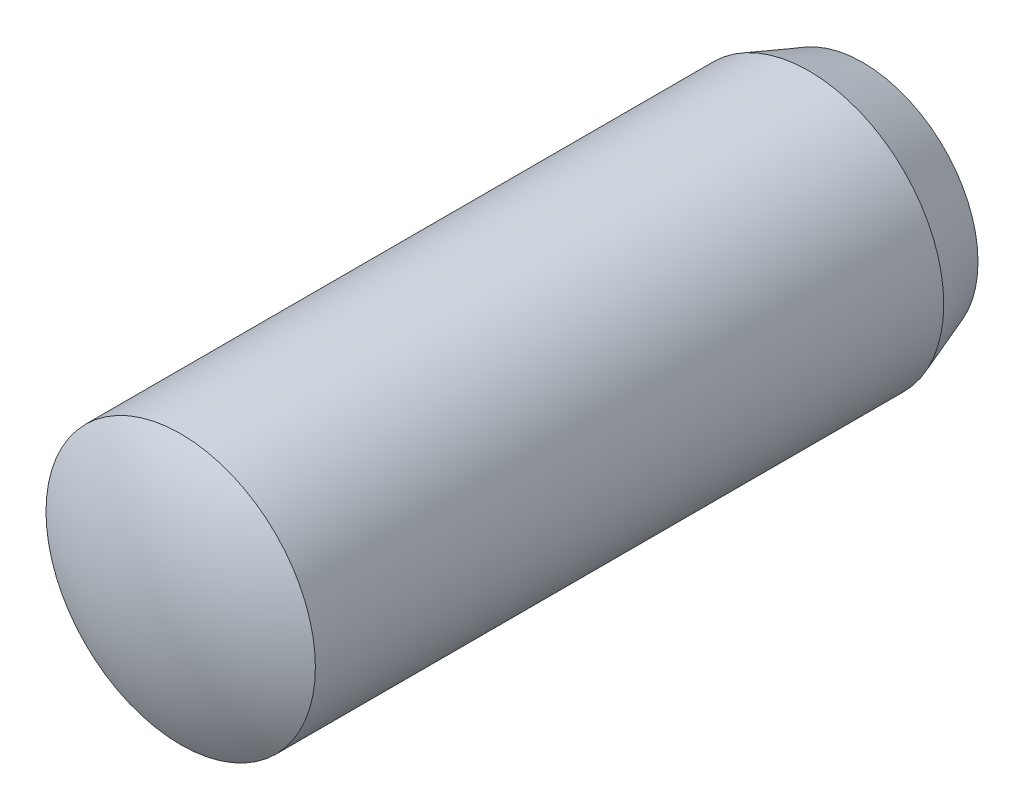
ISO-10303-21;
HEADER;
FILE_DESCRIPTION(('STEP AP214'),'2;1');
FILE_NAME('part.step','',(''),(''),'','','');
FILE_SCHEMA(('AUTOMOTIVE_DESIGN { 1 0 10303 214 1 1 1 1 }'));
ENDSEC;
DATA;
#1=APPLICATION_CONTEXT('core data for automotive mechanical design processes');
#2=APPLICATION_PROTOCOL_DEFINITION('international standard','automotive_design',2000,#1);
#3=PRODUCT_CONTEXT('',#1,'mechanical');
#4=PRODUCT('Part','Part','',(#3));
#5=PRODUCT_RELATED_PRODUCT_CATEGORY('part','',(#4));
#6=PRODUCT_DEFINITION_FORMATION('','',#4);
#7=PRODUCT_DEFINITION_CONTEXT('part definition',#1,'design');
#8=PRODUCT_DEFINITION('design','',#6,#7);
#9=PRODUCT_DEFINITION_SHAPE('','',#8);
#10=(LENGTH_UNIT() NAMED_UNIT(*) SI_UNIT(.MILLI.,.METRE.));
#11=(NAMED_UNIT(*) PLANE_ANGLE_UNIT() SI_UNIT($,.RADIAN.));
#12=(NAMED_UNIT(*) SI_UNIT($,.STERADIAN.) SOLID_ANGLE_UNIT());
#13=UNCERTAINTY_MEASURE_WITH_UNIT(LENGTH_MEASURE(1.E-05),#10,'distance_accuracy_value','');
#14=(GEOMETRIC_REPRESENTATION_CONTEXT(3) GLOBAL_UNCERTAINTY_ASSIGNED_CONTEXT((#13)) GLOBAL_UNIT_ASSIGNED_CONTEXT((#10,
#11,#12)) REPRESENTATION_CONTEXT('',''));
#15=CARTESIAN_POINT('',(0.,0.,0.));
#16=DIRECTION('',(0.,0.,1.));
#17=DIRECTION('',(1.,0.,0.));
#18=AXIS2_PLACEMENT_3D('',#15,#16,#17);
#19=CARTESIAN_POINT('',(0.,2.56323571888056,0.));
#20=DIRECTION('',(0.,0.,0.999999999999999));
#21=DIRECTION('',(1.,0.,0.));
#22=AXIS2_PLACEMENT_3D('',#19,#20,#21);
#23=PLANE('',#22);
#24=CARTESIAN_POINT('',(0.,0.,0.));
#25=DIRECTION('',(0.,0.,-0.999999999999999));
#26=DIRECTION('',(-1.,0.,0.));
#27=AXIS2_PLACEMENT_3D('',#24,#25,#26);
#28=CIRCLE('',#27,2.56323571888055);
#29=CARTESIAN_POINT('',(-2.56323571888056,0.,0.));
#30=VERTEX_POINT('',#29);
#31=EDGE_CURVE('E28',#30,#30,#28,.T.);
#32=ORIENTED_EDGE('',*,*,#31,.T.);
#33=EDGE_LOOP('',(#32));
#34=FACE_BOUND('',#33,.T.);
#35=ADVANCED_FACE('F14',(#34),#23,.F.);
#36=CARTESIAN_POINT('',(0.,0.,9.99999999999995));
#37=DIRECTION('',(-1.,0.,0.));
#38=DIRECTION('',(0.,0.,0.999999999999999));
#39=AXIS2_PLACEMENT_3D('',#36,#37,#38);
#40=SPHERICAL_SURFACE('',#39,6.);
#41=CARTESIAN_POINT('',(0.,0.,9.99999999999995));
#42=DIRECTION('',(0.,0.,-1.));
#43=DIRECTION('',(-1.,0.,0.));
#44=AXIS2_PLACEMENT_3D('',#41,#42,#43);
#45=SPHERICAL_SURFACE('',#44,6.);
#46=CARTESIAN_POINT('',(0.,0.,15.1961524227066));
#47=DIRECTION('',(0.,0.,-0.999999999999999));
#48=DIRECTION('',(-1.,0.,0.));
#49=AXIS2_PLACEMENT_3D('',#46,#47,#48);
#50=CIRCLE('',#49,3.);
#51=CARTESIAN_POINT('',(-3.,0.,15.1961524227066));
#52=VERTEX_POINT('',#51);
#53=EDGE_CURVE('E10',#52,#52,#50,.T.);
#54=ORIENTED_EDGE('',*,*,#53,.F.);
#55=EDGE_LOOP('',(#54));
#56=FACE_BOUND('',#55,.T.);
#57=ADVANCED_FACE('F47',(#56),#45,.T.);
#58=CARTESIAN_POINT('',(0.,0.,0.));
#59=DIRECTION('',(0.,0.,-0.999999999999999));
#60=DIRECTION('',(-1.,0.,0.));
#61=AXIS2_PLACEMENT_3D('',#58,#59,#60);
#62=CYLINDRICAL_SURFACE('',#61,3.);
#63=CARTESIAN_POINT('',(0.,0.,1.19999999999998));
#64=DIRECTION('',(0.,0.,-0.999999999999999));
#65=DIRECTION('',(-1.,0.,0.));
#66=AXIS2_PLACEMENT_3D('',#63,#64,#65);
#67=CIRCLE('',#66,3.);
#68=CARTESIAN_POINT('',(-3.,0.,1.19999999999998));
#69=VERTEX_POINT('',#68);
#70=EDGE_CURVE('E21',#69,#69,#67,.T.);
#71=ORIENTED_EDGE('',*,*,#70,.F.);
#72=EDGE_LOOP('',(#71));
#73=FACE_BOUND('',#72,.T.);
#74=ORIENTED_EDGE('',*,*,#53,.T.);
#75=EDGE_LOOP('',(#74));
#76=FACE_BOUND('',#75,.T.);
#77=ADVANCED_FACE('F41',(#73,#76),#62,.T.);
#78=CARTESIAN_POINT('',(0.,0.,1.19999999999998));
#79=DIRECTION('',(0.,0.,0.999999999999999));
#80=DIRECTION('',(1.,0.,0.));
#81=AXIS2_PLACEMENT_3D('',#78,#79,#80);
#82=CONICAL_SURFACE('',#81,3.,0.349065850398866);
#83=ORIENTED_EDGE('',*,*,#31,.F.);
#84=EDGE_LOOP('',(#83));
#85=FACE_BOUND('',#84,.T.);
#86=ORIENTED_EDGE('',*,*,#70,.T.);
#87=EDGE_LOOP('',(#86));
#88=FACE_BOUND('',#87,.T.);
#89=ADVANCED_FACE('F39',(#85,#88),#82,.T.);
#90=CLOSED_SHELL('',(#35,#57,#77,#89));
#91=MANIFOLD_SOLID_BREP('B1',#90);
#92=ADVANCED_BREP_SHAPE_REPRESENTATION('',(#18,#91),#14);
#93=SHAPE_DEFINITION_REPRESENTATION(#9,#92);
ENDSEC;
END-ISO-10303-21;
